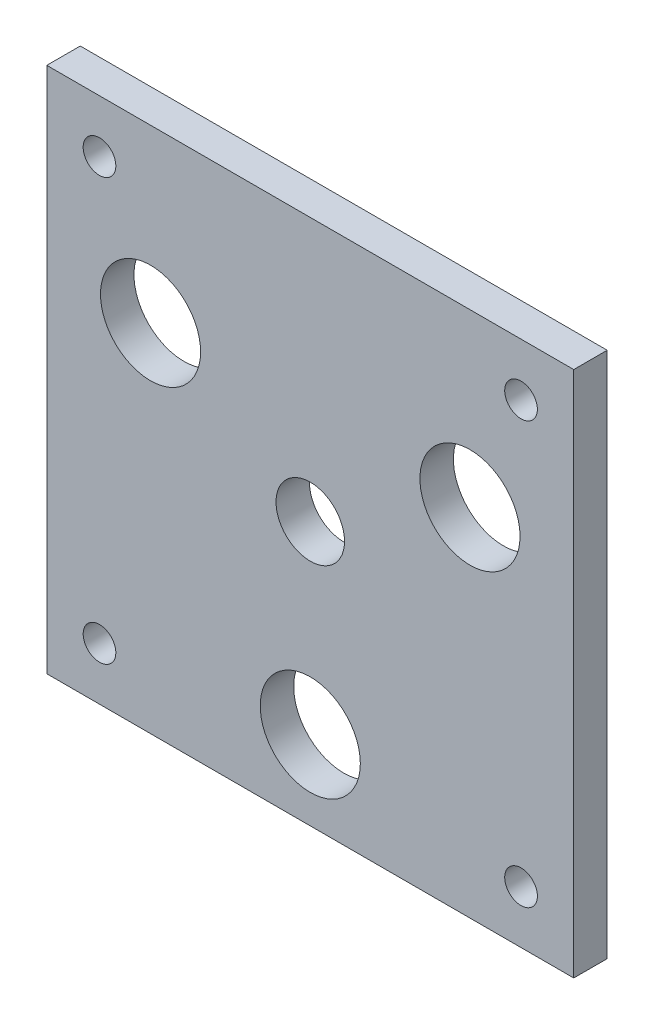
ISO-10303-21;
HEADER;
FILE_DESCRIPTION(('STEP AP214'),'2;1');
FILE_NAME('part.step','',(''),(''),'','','');
FILE_SCHEMA(('AUTOMOTIVE_DESIGN { 1 0 10303 214 1 1 1 1 }'));
ENDSEC;
DATA;
#1=APPLICATION_CONTEXT('core data for automotive mechanical design processes');
#2=APPLICATION_PROTOCOL_DEFINITION('international standard','automotive_design',2000,#1);
#3=PRODUCT_CONTEXT('',#1,'mechanical');
#4=PRODUCT('Part','Part','',(#3));
#5=PRODUCT_RELATED_PRODUCT_CATEGORY('part','',(#4));
#6=PRODUCT_DEFINITION_FORMATION('','',#4);
#7=PRODUCT_DEFINITION_CONTEXT('part definition',#1,'design');
#8=PRODUCT_DEFINITION('design','',#6,#7);
#9=PRODUCT_DEFINITION_SHAPE('','',#8);
#10=(LENGTH_UNIT() NAMED_UNIT(*) SI_UNIT(.MILLI.,.METRE.));
#11=(NAMED_UNIT(*) PLANE_ANGLE_UNIT() SI_UNIT($,.RADIAN.));
#12=(NAMED_UNIT(*) SI_UNIT($,.STERADIAN.) SOLID_ANGLE_UNIT());
#13=UNCERTAINTY_MEASURE_WITH_UNIT(LENGTH_MEASURE(1.E-05),#10,'distance_accuracy_value','');
#14=(GEOMETRIC_REPRESENTATION_CONTEXT(3) GLOBAL_UNCERTAINTY_ASSIGNED_CONTEXT((#13)) GLOBAL_UNIT_ASSIGNED_CONTEXT((#10,
#11,#12)) REPRESENTATION_CONTEXT('',''));
#15=CARTESIAN_POINT('',(0.,0.,0.));
#16=DIRECTION('',(0.,0.,1.));
#17=DIRECTION('',(1.,0.,0.));
#18=AXIS2_PLACEMENT_3D('',#15,#16,#17);
#19=CARTESIAN_POINT('',(0.,0.,6.35));
#20=DIRECTION('',(0.,0.,-1.));
#21=DIRECTION('',(-1.,0.,0.));
#22=AXIS2_PLACEMENT_3D('',#19,#20,#21);
#23=PLANE('',#22);
#24=CARTESIAN_POINT('',(40.,-40.,6.35));
#25=DIRECTION('',(0.,0.,1.));
#26=DIRECTION('',(1.,0.,0.));
#27=AXIS2_PLACEMENT_3D('',#24,#25,#26);
#28=CIRCLE('',#27,3.09999999999999);
#29=CARTESIAN_POINT('',(43.1,-40.,6.35));
#30=VERTEX_POINT('',#29);
#31=EDGE_CURVE('E141',#30,#30,#28,.T.);
#32=ORIENTED_EDGE('',*,*,#31,.F.);
#33=EDGE_LOOP('',(#32));
#34=FACE_BOUND('',#33,.T.);
#35=CARTESIAN_POINT('',(-40.,-40.,6.35));
#36=DIRECTION('',(0.,0.,1.));
#37=DIRECTION('',(1.,0.,0.));
#38=AXIS2_PLACEMENT_3D('',#35,#36,#37);
#39=CIRCLE('',#38,3.09999999999999);
#40=CARTESIAN_POINT('',(-36.9,-40.,6.35));
#41=VERTEX_POINT('',#40);
#42=EDGE_CURVE('E147',#41,#41,#39,.T.);
#43=ORIENTED_EDGE('',*,*,#42,.F.);
#44=EDGE_LOOP('',(#43));
#45=FACE_BOUND('',#44,.T.);
#46=CARTESIAN_POINT('',(40.,40.,6.35));
#47=DIRECTION('',(0.,0.,1.));
#48=DIRECTION('',(1.,0.,0.));
#49=AXIS2_PLACEMENT_3D('',#46,#47,#48);
#50=CIRCLE('',#49,3.09999999999999);
#51=CARTESIAN_POINT('',(43.1,40.,6.35));
#52=VERTEX_POINT('',#51);
#53=EDGE_CURVE('E153',#52,#52,#50,.T.);
#54=ORIENTED_EDGE('',*,*,#53,.F.);
#55=EDGE_LOOP('',(#54));
#56=FACE_BOUND('',#55,.T.);
#57=CARTESIAN_POINT('',(-40.,40.,6.35));
#58=DIRECTION('',(0.,0.,1.));
#59=DIRECTION('',(1.,0.,0.));
#60=AXIS2_PLACEMENT_3D('',#57,#58,#59);
#61=CIRCLE('',#60,3.09999999999999);
#62=CARTESIAN_POINT('',(-36.9,40.,6.35));
#63=VERTEX_POINT('',#62);
#64=EDGE_CURVE('E135',#63,#63,#61,.T.);
#65=ORIENTED_EDGE('',*,*,#64,.F.);
#66=EDGE_LOOP('',(#65));
#67=FACE_BOUND('',#66,.T.);
#68=CARTESIAN_POINT('',(0.,0.,6.35));
#69=DIRECTION('',(0.,0.,1.));
#70=DIRECTION('',(1.,0.,0.));
#71=AXIS2_PLACEMENT_3D('',#68,#69,#70);
#72=CIRCLE('',#71,6.5);
#73=CARTESIAN_POINT('',(6.5,0.,6.35));
#74=VERTEX_POINT('',#73);
#75=EDGE_CURVE('E129',#74,#74,#72,.T.);
#76=ORIENTED_EDGE('',*,*,#75,.F.);
#77=EDGE_LOOP('',(#76));
#78=FACE_BOUND('',#77,.T.);
#79=DIRECTION('',(0.,1.,0.));
#80=VECTOR('',#79,1.);
#81=CARTESIAN_POINT('',(50.,-50.,6.35));
#82=LINE('',#81,#80);
#83=CARTESIAN_POINT('',(50.,-50.,6.35));
#84=VERTEX_POINT('',#83);
#85=CARTESIAN_POINT('',(50.,50.,6.35));
#86=VERTEX_POINT('',#85);
#87=EDGE_CURVE('E87',#84,#86,#82,.T.);
#88=ORIENTED_EDGE('',*,*,#87,.T.);
#89=DIRECTION('',(-1.,0.,0.));
#90=VECTOR('',#89,1.);
#91=CARTESIAN_POINT('',(-50.,50.,6.35));
#92=LINE('',#91,#90);
#93=CARTESIAN_POINT('',(-50.,50.,6.35));
#94=VERTEX_POINT('',#93);
#95=EDGE_CURVE('E82',#86,#94,#92,.T.);
#96=ORIENTED_EDGE('',*,*,#95,.T.);
#97=DIRECTION('',(0.,-1.,0.));
#98=VECTOR('',#97,1.);
#99=CARTESIAN_POINT('',(-50.,-50.,6.35));
#100=LINE('',#99,#98);
#101=CARTESIAN_POINT('',(-50.,-50.,6.35));
#102=VERTEX_POINT('',#101);
#103=EDGE_CURVE('E85',#94,#102,#100,.T.);
#104=ORIENTED_EDGE('',*,*,#103,.T.);
#105=DIRECTION('',(1.,0.,0.));
#106=VECTOR('',#105,1.);
#107=CARTESIAN_POINT('',(-50.,-50.,6.35));
#108=LINE('',#107,#106);
#109=EDGE_CURVE('E52',#102,#84,#108,.T.);
#110=ORIENTED_EDGE('',*,*,#109,.T.);
#111=EDGE_LOOP('',(#88,#96,#104,#110));
#112=FACE_BOUND('',#111,.T.);
#113=CARTESIAN_POINT('',(0.,-35.,6.35));
#114=DIRECTION('',(0.,0.,1.));
#115=DIRECTION('',(1.,0.,0.));
#116=AXIS2_PLACEMENT_3D('',#113,#114,#115);
#117=CIRCLE('',#116,9.5);
#118=CARTESIAN_POINT('',(9.5,-35.,6.35));
#119=VERTEX_POINT('',#118);
#120=EDGE_CURVE('E102',#119,#119,#117,.T.);
#121=ORIENTED_EDGE('',*,*,#120,.F.);
#122=EDGE_LOOP('',(#121));
#123=FACE_BOUND('',#122,.T.);
#124=CARTESIAN_POINT('',(-30.3108891324553,17.4999999999999,6.35));
#125=DIRECTION('',(0.,0.,1.));
#126=DIRECTION('',(1.,0.,0.));
#127=AXIS2_PLACEMENT_3D('',#124,#125,#126);
#128=CIRCLE('',#127,9.5);
#129=CARTESIAN_POINT('',(-20.8108891324553,17.4999999999999,6.35));
#130=VERTEX_POINT('',#129);
#131=EDGE_CURVE('E117',#130,#130,#128,.T.);
#132=ORIENTED_EDGE('',*,*,#131,.F.);
#133=EDGE_LOOP('',(#132));
#134=FACE_BOUND('',#133,.T.);
#135=CARTESIAN_POINT('',(30.3108891324553,17.4999999999999,6.35));
#136=DIRECTION('',(0.,0.,1.));
#137=DIRECTION('',(1.,0.,0.));
#138=AXIS2_PLACEMENT_3D('',#135,#136,#137);
#139=CIRCLE('',#138,9.5);
#140=CARTESIAN_POINT('',(39.8108891324553,17.4999999999999,6.35));
#141=VERTEX_POINT('',#140);
#142=EDGE_CURVE('E123',#141,#141,#139,.T.);
#143=ORIENTED_EDGE('',*,*,#142,.F.);
#144=EDGE_LOOP('',(#143));
#145=FACE_BOUND('',#144,.T.);
#146=ADVANCED_FACE('F35',(#34,#45,#56,#67,#78,#112,#123,#134,#145),#23,.F.);
#147=CARTESIAN_POINT('',(0.,0.,0.));
#148=DIRECTION('',(0.,0.,-1.));
#149=DIRECTION('',(-1.,0.,0.));
#150=AXIS2_PLACEMENT_3D('',#147,#148,#149);
#151=PLANE('',#150);
#152=CARTESIAN_POINT('',(40.,-40.,0.));
#153=DIRECTION('',(0.,0.,-1.));
#154=DIRECTION('',(-1.,0.,0.));
#155=AXIS2_PLACEMENT_3D('',#152,#153,#154);
#156=CIRCLE('',#155,3.09999999999999);
#157=CARTESIAN_POINT('',(36.9,-40.,0.));
#158=VERTEX_POINT('',#157);
#159=EDGE_CURVE('E138',#158,#158,#156,.F.);
#160=ORIENTED_EDGE('',*,*,#159,.T.);
#161=EDGE_LOOP('',(#160));
#162=FACE_BOUND('',#161,.T.);
#163=CARTESIAN_POINT('',(-40.,-40.,0.));
#164=DIRECTION('',(0.,0.,-1.));
#165=DIRECTION('',(-1.,0.,0.));
#166=AXIS2_PLACEMENT_3D('',#163,#164,#165);
#167=CIRCLE('',#166,3.09999999999999);
#168=CARTESIAN_POINT('',(-43.1,-40.,0.));
#169=VERTEX_POINT('',#168);
#170=EDGE_CURVE('E144',#169,#169,#167,.F.);
#171=ORIENTED_EDGE('',*,*,#170,.T.);
#172=EDGE_LOOP('',(#171));
#173=FACE_BOUND('',#172,.T.);
#174=CARTESIAN_POINT('',(40.,40.,0.));
#175=DIRECTION('',(0.,0.,-1.));
#176=DIRECTION('',(-1.,0.,0.));
#177=AXIS2_PLACEMENT_3D('',#174,#175,#176);
#178=CIRCLE('',#177,3.09999999999999);
#179=CARTESIAN_POINT('',(36.9,40.,0.));
#180=VERTEX_POINT('',#179);
#181=EDGE_CURVE('E150',#180,#180,#178,.F.);
#182=ORIENTED_EDGE('',*,*,#181,.T.);
#183=EDGE_LOOP('',(#182));
#184=FACE_BOUND('',#183,.T.);
#185=CARTESIAN_POINT('',(-40.,40.,0.));
#186=DIRECTION('',(0.,0.,-1.));
#187=DIRECTION('',(-1.,0.,0.));
#188=AXIS2_PLACEMENT_3D('',#185,#186,#187);
#189=CIRCLE('',#188,3.09999999999999);
#190=CARTESIAN_POINT('',(-43.1,40.,0.));
#191=VERTEX_POINT('',#190);
#192=EDGE_CURVE('E156',#191,#191,#189,.F.);
#193=ORIENTED_EDGE('',*,*,#192,.T.);
#194=EDGE_LOOP('',(#193));
#195=FACE_BOUND('',#194,.T.);
#196=CARTESIAN_POINT('',(0.,0.,0.));
#197=DIRECTION('',(0.,0.,-1.));
#198=DIRECTION('',(-1.,0.,0.));
#199=AXIS2_PLACEMENT_3D('',#196,#197,#198);
#200=CIRCLE('',#199,6.5);
#201=CARTESIAN_POINT('',(-6.5,0.,0.));
#202=VERTEX_POINT('',#201);
#203=EDGE_CURVE('E132',#202,#202,#200,.F.);
#204=ORIENTED_EDGE('',*,*,#203,.T.);
#205=EDGE_LOOP('',(#204));
#206=FACE_BOUND('',#205,.T.);
#207=CARTESIAN_POINT('',(-30.3108891324553,17.4999999999999,0.));
#208=DIRECTION('',(0.,0.,1.));
#209=DIRECTION('',(1.,0.,0.));
#210=AXIS2_PLACEMENT_3D('',#207,#208,#209);
#211=CIRCLE('',#210,9.5);
#212=CARTESIAN_POINT('',(-20.8108891324553,17.4999999999999,0.));
#213=VERTEX_POINT('',#212);
#214=EDGE_CURVE('E120',#213,#213,#211,.T.);
#215=ORIENTED_EDGE('',*,*,#214,.T.);
#216=EDGE_LOOP('',(#215));
#217=FACE_BOUND('',#216,.T.);
#218=DIRECTION('',(0.,1.,0.));
#219=VECTOR('',#218,1.);
#220=CARTESIAN_POINT('',(50.,-50.,0.));
#221=LINE('',#220,#219);
#222=CARTESIAN_POINT('',(50.,-50.,0.));
#223=VERTEX_POINT('',#222);
#224=CARTESIAN_POINT('',(50.,50.,0.));
#225=VERTEX_POINT('',#224);
#226=EDGE_CURVE('E99',#223,#225,#221,.T.);
#227=ORIENTED_EDGE('',*,*,#226,.F.);
#228=DIRECTION('',(1.,0.,0.));
#229=VECTOR('',#228,1.);
#230=CARTESIAN_POINT('',(-50.,-50.,0.));
#231=LINE('',#230,#229);
#232=CARTESIAN_POINT('',(-50.,-50.,0.));
#233=VERTEX_POINT('',#232);
#234=EDGE_CURVE('E75',#233,#223,#231,.T.);
#235=ORIENTED_EDGE('',*,*,#234,.F.);
#236=DIRECTION('',(0.,-1.,0.));
#237=VECTOR('',#236,1.);
#238=CARTESIAN_POINT('',(-50.,-50.,0.));
#239=LINE('',#238,#237);
#240=CARTESIAN_POINT('',(-50.,50.,0.));
#241=VERTEX_POINT('',#240);
#242=EDGE_CURVE('E69',#241,#233,#239,.T.);
#243=ORIENTED_EDGE('',*,*,#242,.F.);
#244=DIRECTION('',(-1.,0.,0.));
#245=VECTOR('',#244,1.);
#246=CARTESIAN_POINT('',(-50.,50.,0.));
#247=LINE('',#246,#245);
#248=EDGE_CURVE('E91',#225,#241,#247,.T.);
#249=ORIENTED_EDGE('',*,*,#248,.F.);
#250=EDGE_LOOP('',(#227,#235,#243,#249));
#251=FACE_BOUND('',#250,.T.);
#252=CARTESIAN_POINT('',(0.,-35.,0.));
#253=DIRECTION('',(0.,0.,1.));
#254=DIRECTION('',(1.,0.,0.));
#255=AXIS2_PLACEMENT_3D('',#252,#253,#254);
#256=CIRCLE('',#255,9.5);
#257=CARTESIAN_POINT('',(9.5,-35.,0.));
#258=VERTEX_POINT('',#257);
#259=EDGE_CURVE('E114',#258,#258,#256,.T.);
#260=ORIENTED_EDGE('',*,*,#259,.T.);
#261=EDGE_LOOP('',(#260));
#262=FACE_BOUND('',#261,.T.);
#263=CARTESIAN_POINT('',(30.3108891324553,17.4999999999999,0.));
#264=DIRECTION('',(0.,0.,1.));
#265=DIRECTION('',(1.,0.,0.));
#266=AXIS2_PLACEMENT_3D('',#263,#264,#265);
#267=CIRCLE('',#266,9.5);
#268=CARTESIAN_POINT('',(39.8108891324553,17.4999999999999,0.));
#269=VERTEX_POINT('',#268);
#270=EDGE_CURVE('E126',#269,#269,#267,.T.);
#271=ORIENTED_EDGE('',*,*,#270,.T.);
#272=EDGE_LOOP('',(#271));
#273=FACE_BOUND('',#272,.T.);
#274=ADVANCED_FACE('F110',(#162,#173,#184,#195,#206,#217,#251,#262,#273),#151,.T.);
#275=CARTESIAN_POINT('',(50.,-50.,6.35));
#276=DIRECTION('',(-1.,0.,0.));
#277=DIRECTION('',(0.,0.,1.));
#278=AXIS2_PLACEMENT_3D('',#275,#276,#277);
#279=PLANE('',#278);
#280=ORIENTED_EDGE('',*,*,#226,.T.);
#281=DIRECTION('',(0.,0.,-1.));
#282=VECTOR('',#281,1.);
#283=CARTESIAN_POINT('',(50.,50.,6.35));
#284=LINE('',#283,#282);
#285=EDGE_CURVE('E11',#86,#225,#284,.T.);
#286=ORIENTED_EDGE('',*,*,#285,.F.);
#287=ORIENTED_EDGE('',*,*,#87,.F.);
#288=DIRECTION('',(0.,0.,-1.));
#289=VECTOR('',#288,1.);
#290=CARTESIAN_POINT('',(50.,-50.,6.35));
#291=LINE('',#290,#289);
#292=EDGE_CURVE('E95',#84,#223,#291,.T.);
#293=ORIENTED_EDGE('',*,*,#292,.T.);
#294=EDGE_LOOP('',(#280,#286,#287,#293));
#295=FACE_BOUND('',#294,.T.);
#296=ADVANCED_FACE('F37',(#295),#279,.F.);
#297=CARTESIAN_POINT('',(-50.,50.,6.35));
#298=DIRECTION('',(0.,-1.,0.));
#299=DIRECTION('',(0.,0.,-1.));
#300=AXIS2_PLACEMENT_3D('',#297,#298,#299);
#301=PLANE('',#300);
#302=ORIENTED_EDGE('',*,*,#248,.T.);
#303=DIRECTION('',(0.,0.,-1.));
#304=VECTOR('',#303,1.);
#305=CARTESIAN_POINT('',(-50.,50.,6.35));
#306=LINE('',#305,#304);
#307=EDGE_CURVE('E44',#94,#241,#306,.T.);
#308=ORIENTED_EDGE('',*,*,#307,.F.);
#309=ORIENTED_EDGE('',*,*,#95,.F.);
#310=ORIENTED_EDGE('',*,*,#285,.T.);
#311=EDGE_LOOP('',(#302,#308,#309,#310));
#312=FACE_BOUND('',#311,.T.);
#313=ADVANCED_FACE('F90',(#312),#301,.F.);
#314=CARTESIAN_POINT('',(-50.,-50.,6.35));
#315=DIRECTION('',(1.,0.,0.));
#316=DIRECTION('',(0.,0.,-1.));
#317=AXIS2_PLACEMENT_3D('',#314,#315,#316);
#318=PLANE('',#317);
#319=ORIENTED_EDGE('',*,*,#242,.T.);
#320=DIRECTION('',(0.,0.,-1.));
#321=VECTOR('',#320,1.);
#322=CARTESIAN_POINT('',(-50.,-50.,6.35));
#323=LINE('',#322,#321);
#324=EDGE_CURVE('E92',#102,#233,#323,.T.);
#325=ORIENTED_EDGE('',*,*,#324,.F.);
#326=ORIENTED_EDGE('',*,*,#103,.F.);
#327=ORIENTED_EDGE('',*,*,#307,.T.);
#328=EDGE_LOOP('',(#319,#325,#326,#327));
#329=FACE_BOUND('',#328,.T.);
#330=ADVANCED_FACE('F93',(#329),#318,.F.);
#331=CARTESIAN_POINT('',(-50.,-50.,6.35));
#332=DIRECTION('',(0.,1.,0.));
#333=DIRECTION('',(0.,0.,1.));
#334=AXIS2_PLACEMENT_3D('',#331,#332,#333);
#335=PLANE('',#334);
#336=ORIENTED_EDGE('',*,*,#234,.T.);
#337=ORIENTED_EDGE('',*,*,#292,.F.);
#338=ORIENTED_EDGE('',*,*,#109,.F.);
#339=ORIENTED_EDGE('',*,*,#324,.T.);
#340=EDGE_LOOP('',(#336,#337,#338,#339));
#341=FACE_BOUND('',#340,.T.);
#342=ADVANCED_FACE('F107',(#341),#335,.F.);
#343=CARTESIAN_POINT('',(0.,-35.,6.35));
#344=DIRECTION('',(0.,0.,-1.));
#345=DIRECTION('',(-1.,0.,0.));
#346=AXIS2_PLACEMENT_3D('',#343,#344,#345);
#347=CYLINDRICAL_SURFACE('',#346,9.5);
#348=ORIENTED_EDGE('',*,*,#120,.T.);
#349=EDGE_LOOP('',(#348));
#350=FACE_BOUND('',#349,.T.);
#351=ORIENTED_EDGE('',*,*,#259,.F.);
#352=EDGE_LOOP('',(#351));
#353=FACE_BOUND('',#352,.T.);
#354=ADVANCED_FACE('F192',(#350,#353),#347,.F.);
#355=CARTESIAN_POINT('',(-30.3108891324553,17.4999999999999,6.35));
#356=DIRECTION('',(0.,0.,-1.));
#357=DIRECTION('',(-1.,0.,0.));
#358=AXIS2_PLACEMENT_3D('',#355,#356,#357);
#359=CYLINDRICAL_SURFACE('',#358,9.5);
#360=ORIENTED_EDGE('',*,*,#131,.T.);
#361=EDGE_LOOP('',(#360));
#362=FACE_BOUND('',#361,.T.);
#363=ORIENTED_EDGE('',*,*,#214,.F.);
#364=EDGE_LOOP('',(#363));
#365=FACE_BOUND('',#364,.T.);
#366=ADVANCED_FACE('F182',(#362,#365),#359,.F.);
#367=CARTESIAN_POINT('',(30.3108891324553,17.4999999999999,6.35));
#368=DIRECTION('',(0.,0.,-1.));
#369=DIRECTION('',(-1.,0.,0.));
#370=AXIS2_PLACEMENT_3D('',#367,#368,#369);
#371=CYLINDRICAL_SURFACE('',#370,9.5);
#372=ORIENTED_EDGE('',*,*,#142,.T.);
#373=EDGE_LOOP('',(#372));
#374=FACE_BOUND('',#373,.T.);
#375=ORIENTED_EDGE('',*,*,#270,.F.);
#376=EDGE_LOOP('',(#375));
#377=FACE_BOUND('',#376,.T.);
#378=ADVANCED_FACE('F172',(#374,#377),#371,.F.);
#379=CARTESIAN_POINT('',(0.,0.,-0.00100000000000013));
#380=DIRECTION('',(0.,0.,1.));
#381=DIRECTION('',(1.,0.,0.));
#382=AXIS2_PLACEMENT_3D('',#379,#380,#381);
#383=CYLINDRICAL_SURFACE('',#382,6.5);
#384=ORIENTED_EDGE('',*,*,#203,.F.);
#385=EDGE_LOOP('',(#384));
#386=FACE_BOUND('',#385,.T.);
#387=ORIENTED_EDGE('',*,*,#75,.T.);
#388=EDGE_LOOP('',(#387));
#389=FACE_BOUND('',#388,.T.);
#390=ADVANCED_FACE('F170',(#386,#389),#383,.F.);
#391=CARTESIAN_POINT('',(-40.,40.,-0.00100000000000013));
#392=DIRECTION('',(0.,0.,1.));
#393=DIRECTION('',(1.,0.,0.));
#394=AXIS2_PLACEMENT_3D('',#391,#392,#393);
#395=CYLINDRICAL_SURFACE('',#394,3.09999999999999);
#396=ORIENTED_EDGE('',*,*,#192,.F.);
#397=EDGE_LOOP('',(#396));
#398=FACE_BOUND('',#397,.T.);
#399=ORIENTED_EDGE('',*,*,#64,.T.);
#400=EDGE_LOOP('',(#399));
#401=FACE_BOUND('',#400,.T.);
#402=ADVANCED_FACE('F162',(#398,#401),#395,.F.);
#403=CARTESIAN_POINT('',(40.,40.,-0.00100000000000013));
#404=DIRECTION('',(0.,0.,1.));
#405=DIRECTION('',(1.,0.,0.));
#406=AXIS2_PLACEMENT_3D('',#403,#404,#405);
#407=CYLINDRICAL_SURFACE('',#406,3.09999999999999);
#408=ORIENTED_EDGE('',*,*,#181,.F.);
#409=EDGE_LOOP('',(#408));
#410=FACE_BOUND('',#409,.T.);
#411=ORIENTED_EDGE('',*,*,#53,.T.);
#412=EDGE_LOOP('',(#411));
#413=FACE_BOUND('',#412,.T.);
#414=ADVANCED_FACE('F179',(#410,#413),#407,.F.);
#415=CARTESIAN_POINT('',(-40.,-40.,-0.00100000000000013));
#416=DIRECTION('',(0.,0.,1.));
#417=DIRECTION('',(1.,0.,0.));
#418=AXIS2_PLACEMENT_3D('',#415,#416,#417);
#419=CYLINDRICAL_SURFACE('',#418,3.09999999999999);
#420=ORIENTED_EDGE('',*,*,#170,.F.);
#421=EDGE_LOOP('',(#420));
#422=FACE_BOUND('',#421,.T.);
#423=ORIENTED_EDGE('',*,*,#42,.T.);
#424=EDGE_LOOP('',(#423));
#425=FACE_BOUND('',#424,.T.);
#426=ADVANCED_FACE('F274',(#422,#425),#419,.F.);
#427=CARTESIAN_POINT('',(40.,-40.,-0.00100000000000013));
#428=DIRECTION('',(0.,0.,1.));
#429=DIRECTION('',(1.,0.,0.));
#430=AXIS2_PLACEMENT_3D('',#427,#428,#429);
#431=CYLINDRICAL_SURFACE('',#430,3.09999999999999);
#432=ORIENTED_EDGE('',*,*,#159,.F.);
#433=EDGE_LOOP('',(#432));
#434=FACE_BOUND('',#433,.T.);
#435=ORIENTED_EDGE('',*,*,#31,.T.);
#436=EDGE_LOOP('',(#435));
#437=FACE_BOUND('',#436,.T.);
#438=ADVANCED_FACE('F187',(#434,#437),#431,.F.);
#439=CLOSED_SHELL('',(#146,#274,#296,#313,#330,#342,#354,#366,#378,#390,#402,#414,#426,#438));
#440=MANIFOLD_SOLID_BREP('B2',#439);
#441=ADVANCED_BREP_SHAPE_REPRESENTATION('',(#18,#440),#14);
#442=SHAPE_DEFINITION_REPRESENTATION(#9,#441);
ENDSEC;
END-ISO-10303-21;
